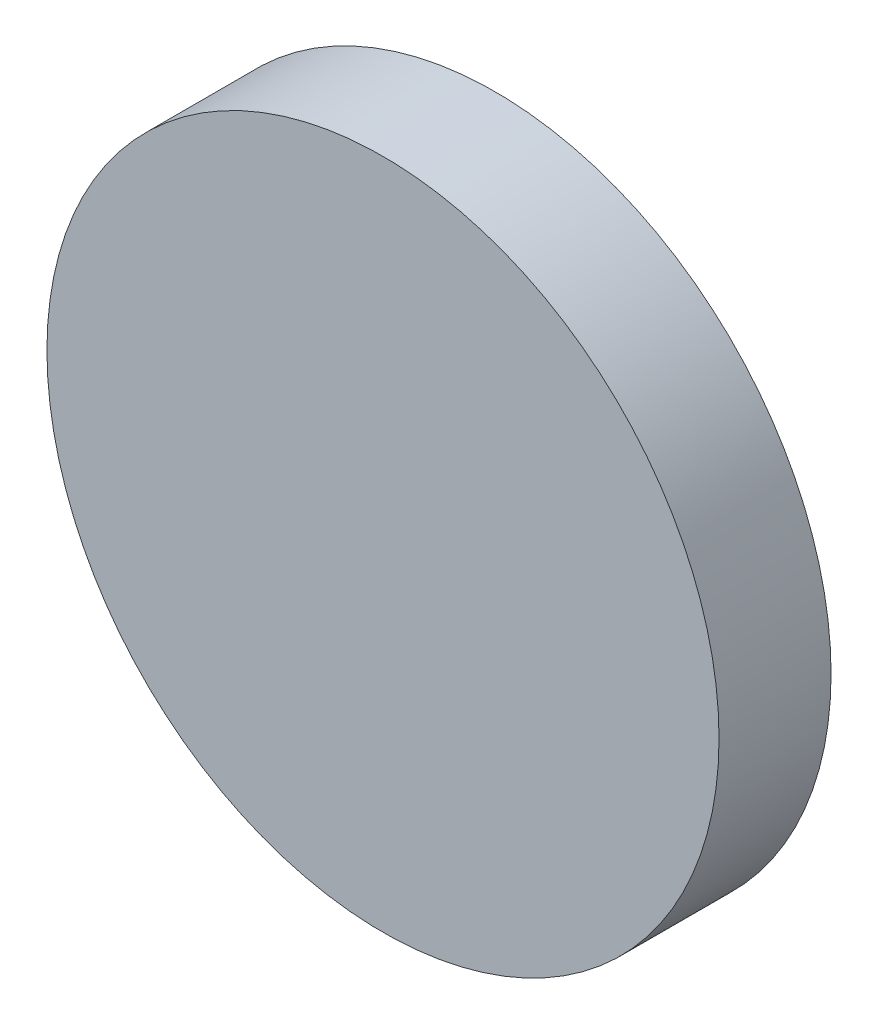
ISO-10303-21;
HEADER;
FILE_DESCRIPTION(('STEP AP214'),'2;1');
FILE_NAME('part.step','',(''),(''),'','','');
FILE_SCHEMA(('AUTOMOTIVE_DESIGN { 1 0 10303 214 1 1 1 1 }'));
ENDSEC;
DATA;
#1=APPLICATION_CONTEXT('core data for automotive mechanical design processes');
#2=APPLICATION_PROTOCOL_DEFINITION('international standard','automotive_design',2000,#1);
#3=PRODUCT_CONTEXT('',#1,'mechanical');
#4=PRODUCT('Part','Part','',(#3));
#5=PRODUCT_RELATED_PRODUCT_CATEGORY('part','',(#4));
#6=PRODUCT_DEFINITION_FORMATION('','',#4);
#7=PRODUCT_DEFINITION_CONTEXT('part definition',#1,'design');
#8=PRODUCT_DEFINITION('design','',#6,#7);
#9=PRODUCT_DEFINITION_SHAPE('','',#8);
#10=(LENGTH_UNIT() NAMED_UNIT(*) SI_UNIT(.MILLI.,.METRE.));
#11=(NAMED_UNIT(*) PLANE_ANGLE_UNIT() SI_UNIT($,.RADIAN.));
#12=(NAMED_UNIT(*) SI_UNIT($,.STERADIAN.) SOLID_ANGLE_UNIT());
#13=UNCERTAINTY_MEASURE_WITH_UNIT(LENGTH_MEASURE(1.E-05),#10,'distance_accuracy_value','');
#14=(GEOMETRIC_REPRESENTATION_CONTEXT(3) GLOBAL_UNCERTAINTY_ASSIGNED_CONTEXT((#13)) GLOBAL_UNIT_ASSIGNED_CONTEXT((#10,
#11,#12)) REPRESENTATION_CONTEXT('',''));
#15=CARTESIAN_POINT('',(0.,0.,0.));
#16=DIRECTION('',(0.,0.,1.));
#17=DIRECTION('',(1.,0.,0.));
#18=AXIS2_PLACEMENT_3D('',#15,#16,#17);
#19=CARTESIAN_POINT('',(0.,0.,2.));
#20=DIRECTION('',(0.,0.,-1.));
#21=DIRECTION('',(-1.,0.,0.));
#22=AXIS2_PLACEMENT_3D('',#19,#20,#21);
#23=CYLINDRICAL_SURFACE('',#22,6.);
#24=CARTESIAN_POINT('',(0.,0.,2.));
#25=DIRECTION('',(0.,0.,1.));
#26=DIRECTION('',(1.,0.,0.));
#27=AXIS2_PLACEMENT_3D('',#24,#25,#26);
#28=CIRCLE('',#27,6.);
#29=CARTESIAN_POINT('',(6.,0.,2.));
#30=VERTEX_POINT('',#29);
#31=EDGE_CURVE('E10',#30,#30,#28,.T.);
#32=ORIENTED_EDGE('',*,*,#31,.F.);
#33=EDGE_LOOP('',(#32));
#34=FACE_BOUND('',#33,.T.);
#35=CARTESIAN_POINT('',(0.,0.,0.));
#36=DIRECTION('',(0.,0.,1.));
#37=DIRECTION('',(1.,0.,0.));
#38=AXIS2_PLACEMENT_3D('',#35,#36,#37);
#39=CIRCLE('',#38,6.);
#40=CARTESIAN_POINT('',(6.,0.,0.));
#41=VERTEX_POINT('',#40);
#42=EDGE_CURVE('E34',#41,#41,#39,.T.);
#43=ORIENTED_EDGE('',*,*,#42,.T.);
#44=EDGE_LOOP('',(#43));
#45=FACE_BOUND('',#44,.T.);
#46=ADVANCED_FACE('F31',(#34,#45),#23,.T.);
#47=CARTESIAN_POINT('',(0.,0.,2.));
#48=DIRECTION('',(0.,0.,1.));
#49=DIRECTION('',(1.,0.,0.));
#50=AXIS2_PLACEMENT_3D('',#47,#48,#49);
#51=PLANE('',#50);
#52=ORIENTED_EDGE('',*,*,#31,.T.);
#53=EDGE_LOOP('',(#52));
#54=FACE_BOUND('',#53,.T.);
#55=ADVANCED_FACE('F46',(#54),#51,.T.);
#56=CARTESIAN_POINT('',(0.,0.,0.));
#57=DIRECTION('',(0.,0.,1.));
#58=DIRECTION('',(1.,0.,0.));
#59=AXIS2_PLACEMENT_3D('',#56,#57,#58);
#60=PLANE('',#59);
#61=ORIENTED_EDGE('',*,*,#42,.F.);
#62=EDGE_LOOP('',(#61));
#63=FACE_BOUND('',#62,.T.);
#64=ADVANCED_FACE('F44',(#63),#60,.F.);
#65=CLOSED_SHELL('',(#46,#55,#64));
#66=MANIFOLD_SOLID_BREP('B2',#65);
#67=ADVANCED_BREP_SHAPE_REPRESENTATION('',(#18,#66),#14);
#68=SHAPE_DEFINITION_REPRESENTATION(#9,#67);
ENDSEC;
END-ISO-10303-21;
